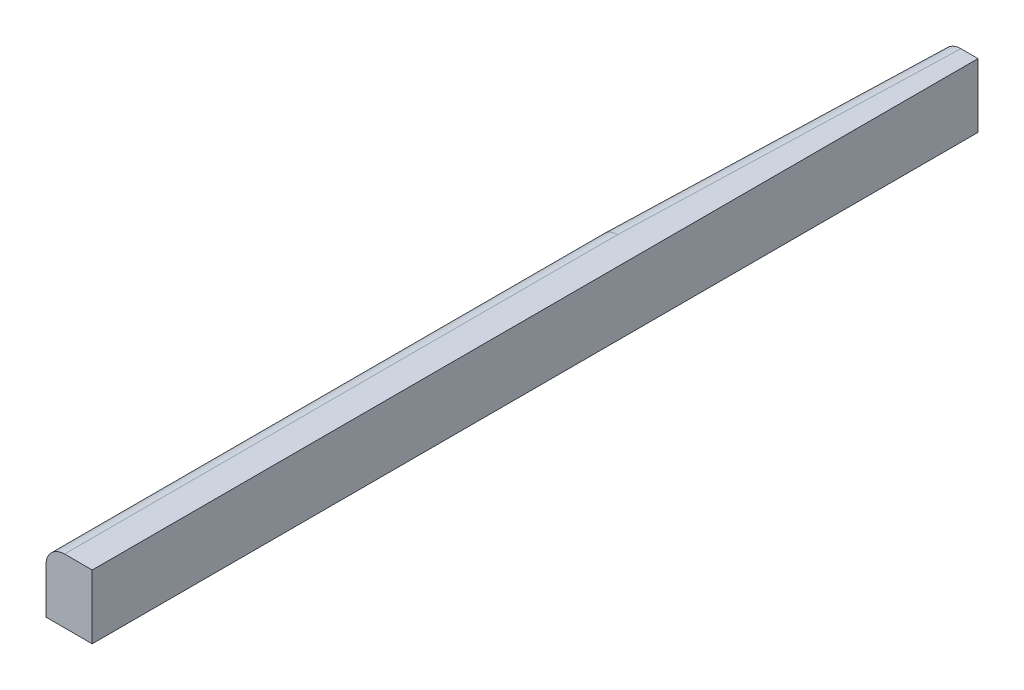
ISO-10303-21;
HEADER;
FILE_DESCRIPTION(('STEP AP214'),'2;1');
FILE_NAME('part.step','',(''),(''),'','','');
FILE_SCHEMA(('AUTOMOTIVE_DESIGN { 1 0 10303 214 1 1 1 1 }'));
ENDSEC;
DATA;
#1=APPLICATION_CONTEXT('core data for automotive mechanical design processes');
#2=APPLICATION_PROTOCOL_DEFINITION('international standard','automotive_design',2000,#1);
#3=PRODUCT_CONTEXT('',#1,'mechanical');
#4=PRODUCT('Part','Part','',(#3));
#5=PRODUCT_RELATED_PRODUCT_CATEGORY('part','',(#4));
#6=PRODUCT_DEFINITION_FORMATION('','',#4);
#7=PRODUCT_DEFINITION_CONTEXT('part definition',#1,'design');
#8=PRODUCT_DEFINITION('design','',#6,#7);
#9=PRODUCT_DEFINITION_SHAPE('','',#8);
#10=(LENGTH_UNIT() NAMED_UNIT(*) SI_UNIT(.MILLI.,.METRE.));
#11=(NAMED_UNIT(*) PLANE_ANGLE_UNIT() SI_UNIT($,.RADIAN.));
#12=(NAMED_UNIT(*) SI_UNIT($,.STERADIAN.) SOLID_ANGLE_UNIT());
#13=UNCERTAINTY_MEASURE_WITH_UNIT(LENGTH_MEASURE(1.E-05),#10,'distance_accuracy_value','');
#14=(GEOMETRIC_REPRESENTATION_CONTEXT(3) GLOBAL_UNCERTAINTY_ASSIGNED_CONTEXT((#13)) GLOBAL_UNIT_ASSIGNED_CONTEXT((#10,
#11,#12)) REPRESENTATION_CONTEXT('',''));
#15=CARTESIAN_POINT('',(0.,0.,0.));
#16=DIRECTION('',(0.,0.,1.));
#17=DIRECTION('',(1.,0.,0.));
#18=AXIS2_PLACEMENT_3D('',#15,#16,#17);
#19=CARTESIAN_POINT('',(-49.911,49.911,25.4));
#20=DIRECTION('',(0.,-1.,0.));
#21=DIRECTION('',(0.,0.,-1.));
#22=AXIS2_PLACEMENT_3D('',#19,#20,#21);
#23=PLANE('',#22);
#24=DIRECTION('',(-1.,0.,0.));
#25=VECTOR('',#24,1.);
#26=CARTESIAN_POINT('',(-78.5898334013736,49.911,24.511));
#27=LINE('',#26,#25);
#28=CARTESIAN_POINT('',(-18.161,49.911,24.511));
#29=VERTEX_POINT('',#28);
#30=CARTESIAN_POINT('',(-37.211,49.911,24.511));
#31=VERTEX_POINT('',#30);
#32=EDGE_CURVE('E97',#29,#31,#27,.T.);
#33=ORIENTED_EDGE('',*,*,#32,.F.);
#34=DIRECTION('',(0.,0.,1.));
#35=VECTOR('',#34,1.);
#36=CARTESIAN_POINT('',(-18.161,49.911,25.4));
#37=LINE('',#36,#35);
#38=CARTESIAN_POINT('',(-18.161,49.911,-584.2));
#39=VERTEX_POINT('',#38);
#40=EDGE_CURVE('E104',#39,#29,#37,.T.);
#41=ORIENTED_EDGE('',*,*,#40,.F.);
#42=DIRECTION('',(-1.,0.,0.));
#43=VECTOR('',#42,1.);
#44=CARTESIAN_POINT('',(-49.911,49.911,-584.2));
#45=LINE('',#44,#43);
#46=CARTESIAN_POINT('',(-29.9639479786131,49.911,-584.2));
#47=VERTEX_POINT('',#46);
#48=EDGE_CURVE('E65',#39,#47,#45,.T.);
#49=ORIENTED_EDGE('',*,*,#48,.T.);
#50=DIRECTION('',(-0.0316721902279268,0.,0.999498310336824));
#51=VECTOR('',#50,1.);
#52=CARTESIAN_POINT('',(-49.2816382741247,49.911,25.4199432696363));
#53=LINE('',#52,#51);
#54=CARTESIAN_POINT('',(-37.211,49.911,-355.500431129881));
#55=VERTEX_POINT('',#54);
#56=EDGE_CURVE('E114',#47,#55,#53,.T.);
#57=ORIENTED_EDGE('',*,*,#56,.T.);
#58=DIRECTION('',(0.,0.,-1.));
#59=VECTOR('',#58,1.);
#60=CARTESIAN_POINT('',(-37.211,49.911,25.4));
#61=LINE('',#60,#59);
#62=EDGE_CURVE('E106',#55,#31,#61,.F.);
#63=ORIENTED_EDGE('',*,*,#62,.T.);
#64=EDGE_LOOP('',(#33,#41,#49,#57,#63));
#65=FACE_BOUND('',#64,.T.);
#66=ADVANCED_FACE('F43',(#65),#23,.F.);
#67=CARTESIAN_POINT('',(-37.211,37.211,25.4));
#68=DIRECTION('',(0.,0.,-1.));
#69=DIRECTION('',(-1.,0.,0.));
#70=AXIS2_PLACEMENT_3D('',#67,#68,#69);
#71=CYLINDRICAL_SURFACE('',#70,12.7);
#72=DIRECTION('',(0.,0.,-1.));
#73=VECTOR('',#72,1.);
#74=CARTESIAN_POINT('',(-49.911,37.211,25.4));
#75=LINE('',#74,#73);
#76=CARTESIAN_POINT('',(-49.911,37.211,24.511));
#77=VERTEX_POINT('',#76);
#78=CARTESIAN_POINT('',(-49.911,37.211,-355.7016));
#79=VERTEX_POINT('',#78);
#80=EDGE_CURVE('E129',#77,#79,#75,.T.);
#81=ORIENTED_EDGE('',*,*,#80,.F.);
#82=CARTESIAN_POINT('',(-37.211,37.211,24.511));
#83=DIRECTION('',(0.,0.,1.));
#84=DIRECTION('',(1.,0.,0.));
#85=AXIS2_PLACEMENT_3D('',#82,#83,#84);
#86=CIRCLE('',#85,12.7);
#87=EDGE_CURVE('E112',#77,#31,#86,.F.);
#88=ORIENTED_EDGE('',*,*,#87,.T.);
#89=ORIENTED_EDGE('',*,*,#62,.F.);
#90=CARTESIAN_POINT('',(-37.211,37.211,-355.500431129881));
#91=DIRECTION('',(-0.0158380816890187,0.,0.999874569717828));
#92=DIRECTION('',(-0.999874569717828,0.,-0.0158380816890199));
#93=AXIS2_PLACEMENT_3D('',#90,#91,#92);
#94=ELLIPSE('',#93,12.7015931644146,12.7);
#95=EDGE_CURVE('E147',#55,#79,#94,.T.);
#96=ORIENTED_EDGE('',*,*,#95,.T.);
#97=EDGE_LOOP('',(#81,#88,#89,#96));
#98=FACE_BOUND('',#97,.T.);
#99=ADVANCED_FACE('F166',(#98),#71,.T.);
#100=CARTESIAN_POINT('',(-49.911,-49.911,25.4));
#101=DIRECTION('',(1.,0.,0.));
#102=DIRECTION('',(0.,0.,-1.));
#103=AXIS2_PLACEMENT_3D('',#100,#101,#102);
#104=PLANE('',#103);
#105=DIRECTION('',(0.,-1.,0.));
#106=VECTOR('',#105,1.);
#107=CARTESIAN_POINT('',(-49.911,-49.911,24.511));
#108=LINE('',#107,#106);
#109=CARTESIAN_POINT('',(-49.911,5.96900000000002,24.511));
#110=VERTEX_POINT('',#109);
#111=EDGE_CURVE('E116',#77,#110,#108,.T.);
#112=ORIENTED_EDGE('',*,*,#111,.F.);
#113=ORIENTED_EDGE('',*,*,#80,.T.);
#114=DIRECTION('',(0.,1.,0.));
#115=VECTOR('',#114,1.);
#116=CARTESIAN_POINT('',(-49.911,-49.911,-355.7016));
#117=LINE('',#116,#115);
#118=CARTESIAN_POINT('',(-49.911,5.96900000000002,-355.7016));
#119=VERTEX_POINT('',#118);
#120=EDGE_CURVE('E120',#79,#119,#117,.F.);
#121=ORIENTED_EDGE('',*,*,#120,.T.);
#122=DIRECTION('',(0.,0.,1.));
#123=VECTOR('',#122,1.);
#124=CARTESIAN_POINT('',(-49.911,5.96900000000002,25.4));
#125=LINE('',#124,#123);
#126=EDGE_CURVE('E141',#119,#110,#125,.T.);
#127=ORIENTED_EDGE('',*,*,#126,.T.);
#128=EDGE_LOOP('',(#112,#113,#121,#127));
#129=FACE_BOUND('',#128,.T.);
#130=ADVANCED_FACE('F167',(#129),#104,.F.);
#131=CARTESIAN_POINT('',(0.,5.96900000000002,0.));
#132=DIRECTION('',(0.,1.,0.));
#133=DIRECTION('',(0.,0.,1.));
#134=AXIS2_PLACEMENT_3D('',#131,#132,#133);
#135=PLANE('',#134);
#136=DIRECTION('',(1.,0.,0.));
#137=VECTOR('',#136,1.);
#138=CARTESIAN_POINT('',(0.,5.96900000000002,24.511));
#139=LINE('',#138,#137);
#140=CARTESIAN_POINT('',(-18.161,5.96900000000002,24.511));
#141=VERTEX_POINT('',#140);
#142=EDGE_CURVE('E58',#110,#141,#139,.T.);
#143=ORIENTED_EDGE('',*,*,#142,.F.);
#144=ORIENTED_EDGE('',*,*,#126,.F.);
#145=DIRECTION('',(-0.0316721902279268,0.,0.999498310336824));
#146=VECTOR('',#145,1.);
#147=CARTESIAN_POINT('',(-61.1211296763861,5.96900000000002,-1.93681172447797));
#148=LINE('',#147,#146);
#149=CARTESIAN_POINT('',(-42.6703226354349,5.96900000000002,-584.2));
#150=VERTEX_POINT('',#149);
#151=EDGE_CURVE('E124',#150,#119,#148,.T.);
#152=ORIENTED_EDGE('',*,*,#151,.F.);
#153=DIRECTION('',(1.,0.,0.));
#154=VECTOR('',#153,1.);
#155=CARTESIAN_POINT('',(0.,5.96900000000002,-584.2));
#156=LINE('',#155,#154);
#157=CARTESIAN_POINT('',(-18.161,5.96900000000002,-584.2));
#158=VERTEX_POINT('',#157);
#159=EDGE_CURVE('E134',#150,#158,#156,.T.);
#160=ORIENTED_EDGE('',*,*,#159,.T.);
#161=DIRECTION('',(0.,0.,1.));
#162=VECTOR('',#161,1.);
#163=CARTESIAN_POINT('',(-18.161,5.96900000000002,0.));
#164=LINE('',#163,#162);
#165=EDGE_CURVE('E139',#158,#141,#164,.T.);
#166=ORIENTED_EDGE('',*,*,#165,.T.);
#167=EDGE_LOOP('',(#143,#144,#152,#160,#166));
#168=FACE_BOUND('',#167,.T.);
#169=ADVANCED_FACE('F170',(#168),#135,.F.);
#170=CARTESIAN_POINT('',(-18.161,0.,0.));
#171=DIRECTION('',(1.,0.,0.));
#172=DIRECTION('',(0.,0.,-1.));
#173=AXIS2_PLACEMENT_3D('',#170,#171,#172);
#174=PLANE('',#173);
#175=ORIENTED_EDGE('',*,*,#40,.T.);
#176=DIRECTION('',(0.,-1.,0.));
#177=VECTOR('',#176,1.);
#178=CARTESIAN_POINT('',(-18.161,0.,24.511));
#179=LINE('',#178,#177);
#180=EDGE_CURVE('E11',#29,#141,#179,.T.);
#181=ORIENTED_EDGE('',*,*,#180,.T.);
#182=ORIENTED_EDGE('',*,*,#165,.F.);
#183=DIRECTION('',(0.,-1.,0.));
#184=VECTOR('',#183,1.);
#185=CARTESIAN_POINT('',(-18.161,0.,-584.2));
#186=LINE('',#185,#184);
#187=EDGE_CURVE('E111',#39,#158,#186,.T.);
#188=ORIENTED_EDGE('',*,*,#187,.F.);
#189=EDGE_LOOP('',(#175,#181,#182,#188));
#190=FACE_BOUND('',#189,.T.);
#191=ADVANCED_FACE('F109',(#190),#174,.T.);
#192=CARTESIAN_POINT('',(0.,0.,-584.2));
#193=DIRECTION('',(0.,0.,1.));
#194=DIRECTION('',(1.,0.,0.));
#195=AXIS2_PLACEMENT_3D('',#192,#193,#194);
#196=PLANE('',#195);
#197=ORIENTED_EDGE('',*,*,#187,.T.);
#198=ORIENTED_EDGE('',*,*,#159,.F.);
#199=DIRECTION('',(0.,-1.,0.));
#200=VECTOR('',#199,1.);
#201=CARTESIAN_POINT('',(-42.6703226354349,0.,-584.2));
#202=LINE('',#201,#200);
#203=CARTESIAN_POINT('',(-42.6703226354349,37.211,-584.2));
#204=VERTEX_POINT('',#203);
#205=EDGE_CURVE('E130',#204,#150,#202,.T.);
#206=ORIENTED_EDGE('',*,*,#205,.F.);
#207=CARTESIAN_POINT('',(-29.9639479786131,37.211,-584.2));
#208=DIRECTION('',(0.,0.,1.));
#209=DIRECTION('',(-1.,0.,0.));
#210=AXIS2_PLACEMENT_3D('',#207,#208,#209);
#211=ELLIPSE('',#210,12.7063746568218,12.7);
#212=EDGE_CURVE('E51',#204,#47,#211,.F.);
#213=ORIENTED_EDGE('',*,*,#212,.T.);
#214=ORIENTED_EDGE('',*,*,#48,.F.);
#215=EDGE_LOOP('',(#197,#198,#206,#213,#214));
#216=FACE_BOUND('',#215,.T.);
#217=ADVANCED_FACE('F45',(#216),#196,.F.);
#218=CARTESIAN_POINT('',(-49.2816382741247,37.211,25.4199432696363));
#219=DIRECTION('',(-0.0316721902279268,0.,0.999498310336824));
#220=DIRECTION('',(0.999498310336824,0.,0.0316721902279268));
#221=AXIS2_PLACEMENT_3D('',#218,#219,#220);
#222=CYLINDRICAL_SURFACE('',#221,12.7);
#223=ORIENTED_EDGE('',*,*,#212,.F.);
#224=DIRECTION('',(-0.0316721902279268,0.,0.999498310336824));
#225=VECTOR('',#224,1.);
#226=CARTESIAN_POINT('',(-61.1211296763861,37.211,-1.93681172447797));
#227=LINE('',#226,#225);
#228=EDGE_CURVE('E156',#79,#204,#227,.F.);
#229=ORIENTED_EDGE('',*,*,#228,.F.);
#230=ORIENTED_EDGE('',*,*,#95,.F.);
#231=ORIENTED_EDGE('',*,*,#56,.F.);
#232=EDGE_LOOP('',(#223,#229,#230,#231));
#233=FACE_BOUND('',#232,.T.);
#234=ADVANCED_FACE('F164',(#233),#222,.T.);
#235=CARTESIAN_POINT('',(-61.1211296763861,0.,-1.93681172447797));
#236=DIRECTION('',(0.999498310336824,0.,0.0316721902279268));
#237=DIRECTION('',(0.0316721902279268,0.,-0.999498310336824));
#238=AXIS2_PLACEMENT_3D('',#235,#236,#237);
#239=PLANE('',#238);
#240=ORIENTED_EDGE('',*,*,#228,.T.);
#241=ORIENTED_EDGE('',*,*,#205,.T.);
#242=ORIENTED_EDGE('',*,*,#151,.T.);
#243=ORIENTED_EDGE('',*,*,#120,.F.);
#244=EDGE_LOOP('',(#240,#241,#242,#243));
#245=FACE_BOUND('',#244,.T.);
#246=ADVANCED_FACE('F162',(#245),#239,.F.);
#247=CARTESIAN_POINT('',(0.,0.,24.511));
#248=DIRECTION('',(0.,0.,1.));
#249=DIRECTION('',(1.,0.,0.));
#250=AXIS2_PLACEMENT_3D('',#247,#248,#249);
#251=PLANE('',#250);
#252=ORIENTED_EDGE('',*,*,#111,.T.);
#253=ORIENTED_EDGE('',*,*,#142,.T.);
#254=ORIENTED_EDGE('',*,*,#180,.F.);
#255=ORIENTED_EDGE('',*,*,#32,.T.);
#256=ORIENTED_EDGE('',*,*,#87,.F.);
#257=EDGE_LOOP('',(#252,#253,#254,#255,#256));
#258=FACE_BOUND('',#257,.T.);
#259=ADVANCED_FACE('F96',(#258),#251,.T.);
#260=CLOSED_SHELL('',(#66,#99,#130,#169,#191,#217,#234,#246,#259));
#261=MANIFOLD_SOLID_BREP('B2',#260);
#262=ADVANCED_BREP_SHAPE_REPRESENTATION('',(#18,#261),#14);
#263=SHAPE_DEFINITION_REPRESENTATION(#9,#262);
ENDSEC;
END-ISO-10303-21;
